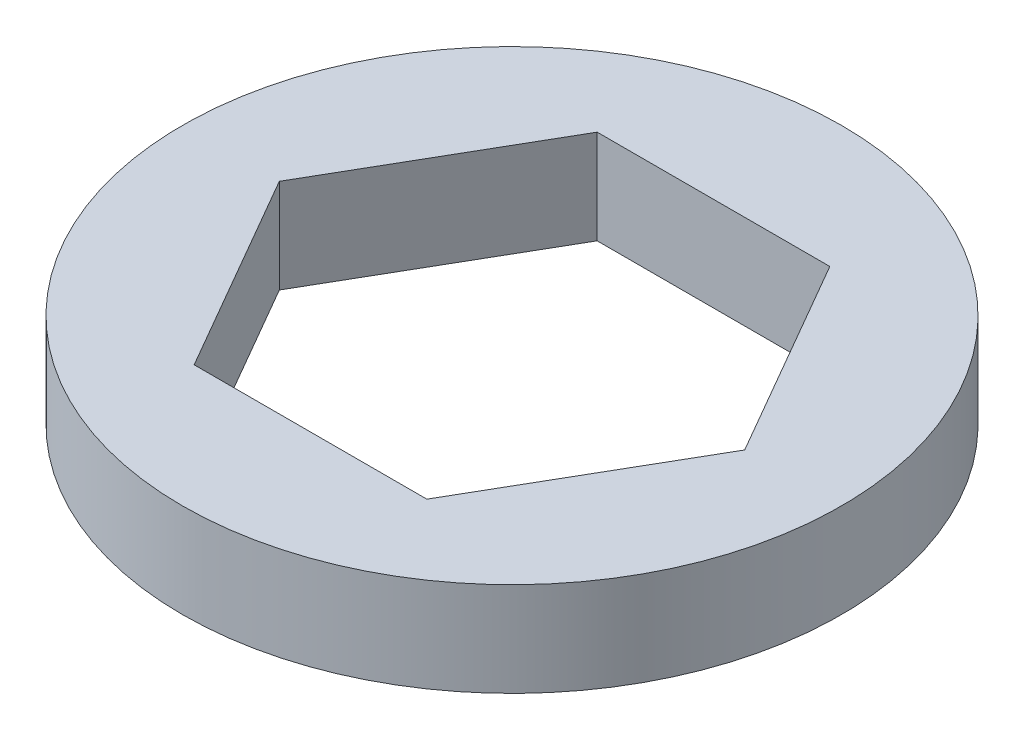
ISO-10303-21;
HEADER;
FILE_DESCRIPTION(('STEP AP214'),'2;1');
FILE_NAME('part.step','',(''),(''),'','','');
FILE_SCHEMA(('AUTOMOTIVE_DESIGN { 1 0 10303 214 1 1 1 1 }'));
ENDSEC;
DATA;
#1=APPLICATION_CONTEXT('core data for automotive mechanical design processes');
#2=APPLICATION_PROTOCOL_DEFINITION('international standard','automotive_design',2000,#1);
#3=PRODUCT_CONTEXT('',#1,'mechanical');
#4=PRODUCT('Part','Part','',(#3));
#5=PRODUCT_RELATED_PRODUCT_CATEGORY('part','',(#4));
#6=PRODUCT_DEFINITION_FORMATION('','',#4);
#7=PRODUCT_DEFINITION_CONTEXT('part definition',#1,'design');
#8=PRODUCT_DEFINITION('design','',#6,#7);
#9=PRODUCT_DEFINITION_SHAPE('','',#8);
#10=(LENGTH_UNIT() NAMED_UNIT(*) SI_UNIT(.MILLI.,.METRE.));
#11=(NAMED_UNIT(*) PLANE_ANGLE_UNIT() SI_UNIT($,.RADIAN.));
#12=(NAMED_UNIT(*) SI_UNIT($,.STERADIAN.) SOLID_ANGLE_UNIT());
#13=UNCERTAINTY_MEASURE_WITH_UNIT(LENGTH_MEASURE(1.E-05),#10,'distance_accuracy_value','');
#14=(GEOMETRIC_REPRESENTATION_CONTEXT(3) GLOBAL_UNCERTAINTY_ASSIGNED_CONTEXT((#13)) GLOBAL_UNIT_ASSIGNED_CONTEXT((#10,
#11,#12)) REPRESENTATION_CONTEXT('',''));
#15=CARTESIAN_POINT('',(0.,0.,0.));
#16=DIRECTION('',(0.,0.,1.));
#17=DIRECTION('',(1.,0.,0.));
#18=AXIS2_PLACEMENT_3D('',#15,#16,#17);
#19=CARTESIAN_POINT('',(0.,3.175,0.));
#20=DIRECTION('',(0.,1.,0.));
#21=DIRECTION('',(0.,0.,1.));
#22=AXIS2_PLACEMENT_3D('',#19,#20,#21);
#23=PLANE('',#22);
#24=CARTESIAN_POINT('',(0.,3.175,0.));
#25=DIRECTION('',(0.,1.,0.));
#26=DIRECTION('',(0.,0.,1.));
#27=AXIS2_PLACEMENT_3D('',#24,#25,#26);
#28=CIRCLE('',#27,11.1125);
#29=CARTESIAN_POINT('',(0.,3.175,11.1125));
#30=VERTEX_POINT('',#29);
#31=EDGE_CURVE('E11',#30,#30,#28,.T.);
#32=ORIENTED_EDGE('',*,*,#31,.T.);
#33=EDGE_LOOP('',(#32));
#34=FACE_BOUND('',#33,.T.);
#35=DIRECTION('',(-0.5,0.,-0.866025403784439));
#36=VECTOR('',#35,1.);
#37=CARTESIAN_POINT('',(7.84561280801783,3.175,0.));
#38=LINE('',#37,#36);
#39=CARTESIAN_POINT('',(7.84561280801783,3.175,0.));
#40=VERTEX_POINT('',#39);
#41=CARTESIAN_POINT('',(3.9228064040089,3.175,-6.79450000000002));
#42=VERTEX_POINT('',#41);
#43=EDGE_CURVE('E107',#40,#42,#38,.T.);
#44=ORIENTED_EDGE('',*,*,#43,.F.);
#45=DIRECTION('',(0.5,0.,-0.866025403784439));
#46=VECTOR('',#45,1.);
#47=CARTESIAN_POINT('',(3.92280640400891,3.175,6.79450000000001));
#48=LINE('',#47,#46);
#49=CARTESIAN_POINT('',(3.92280640400891,3.175,6.79450000000001));
#50=VERTEX_POINT('',#49);
#51=EDGE_CURVE('E98',#50,#40,#48,.T.);
#52=ORIENTED_EDGE('',*,*,#51,.F.);
#53=DIRECTION('',(1.,0.,0.));
#54=VECTOR('',#53,1.);
#55=CARTESIAN_POINT('',(-3.92280640400892,3.175,6.79450000000001));
#56=LINE('',#55,#54);
#57=CARTESIAN_POINT('',(-3.92280640400892,3.175,6.79450000000001));
#58=VERTEX_POINT('',#57);
#59=EDGE_CURVE('E131',#58,#50,#56,.T.);
#60=ORIENTED_EDGE('',*,*,#59,.F.);
#61=DIRECTION('',(0.5,0.,0.866025403784439));
#62=VECTOR('',#61,1.);
#63=CARTESIAN_POINT('',(-7.84561280801784,3.175,0.));
#64=LINE('',#63,#62);
#65=CARTESIAN_POINT('',(-7.84561280801784,3.175,0.));
#66=VERTEX_POINT('',#65);
#67=EDGE_CURVE('E128',#66,#58,#64,.T.);
#68=ORIENTED_EDGE('',*,*,#67,.F.);
#69=DIRECTION('',(-0.5,0.,0.866025403784439));
#70=VECTOR('',#69,1.);
#71=CARTESIAN_POINT('',(-3.92280640400892,3.175,-6.79450000000002));
#72=LINE('',#71,#70);
#73=CARTESIAN_POINT('',(-3.92280640400892,3.175,-6.79450000000002));
#74=VERTEX_POINT('',#73);
#75=EDGE_CURVE('E124',#74,#66,#72,.T.);
#76=ORIENTED_EDGE('',*,*,#75,.F.);
#77=DIRECTION('',(-1.,0.,0.));
#78=VECTOR('',#77,1.);
#79=CARTESIAN_POINT('',(3.9228064040089,3.175,-6.79450000000002));
#80=LINE('',#79,#78);
#81=EDGE_CURVE('E120',#42,#74,#80,.T.);
#82=ORIENTED_EDGE('',*,*,#81,.F.);
#83=EDGE_LOOP('',(#44,#52,#60,#68,#76,#82));
#84=FACE_BOUND('',#83,.T.);
#85=ADVANCED_FACE('F36',(#34,#84),#23,.T.);
#86=CARTESIAN_POINT('',(0.,0.,0.));
#87=DIRECTION('',(0.,1.,0.));
#88=DIRECTION('',(0.,0.,1.));
#89=AXIS2_PLACEMENT_3D('',#86,#87,#88);
#90=PLANE('',#89);
#91=CARTESIAN_POINT('',(0.,0.,0.));
#92=DIRECTION('',(0.,1.,0.));
#93=DIRECTION('',(0.,0.,1.));
#94=AXIS2_PLACEMENT_3D('',#91,#92,#93);
#95=CIRCLE('',#94,11.1125);
#96=CARTESIAN_POINT('',(0.,0.,11.1125));
#97=VERTEX_POINT('',#96);
#98=EDGE_CURVE('E40',#97,#97,#95,.T.);
#99=ORIENTED_EDGE('',*,*,#98,.F.);
#100=EDGE_LOOP('',(#99));
#101=FACE_BOUND('',#100,.T.);
#102=DIRECTION('',(0.5,0.,-0.866025403784439));
#103=VECTOR('',#102,1.);
#104=CARTESIAN_POINT('',(3.92280640400891,0.,6.79450000000001));
#105=LINE('',#104,#103);
#106=CARTESIAN_POINT('',(3.92280640400891,0.,6.79450000000001));
#107=VERTEX_POINT('',#106);
#108=CARTESIAN_POINT('',(7.84561280801783,0.,0.));
#109=VERTEX_POINT('',#108);
#110=EDGE_CURVE('E64',#107,#109,#105,.T.);
#111=ORIENTED_EDGE('',*,*,#110,.T.);
#112=DIRECTION('',(-0.5,0.,-0.866025403784439));
#113=VECTOR('',#112,1.);
#114=CARTESIAN_POINT('',(7.84561280801783,0.,0.));
#115=LINE('',#114,#113);
#116=CARTESIAN_POINT('',(3.9228064040089,0.,-6.79450000000002));
#117=VERTEX_POINT('',#116);
#118=EDGE_CURVE('E114',#109,#117,#115,.T.);
#119=ORIENTED_EDGE('',*,*,#118,.T.);
#120=DIRECTION('',(-1.,0.,0.));
#121=VECTOR('',#120,1.);
#122=CARTESIAN_POINT('',(3.9228064040089,0.,-6.79450000000002));
#123=LINE('',#122,#121);
#124=CARTESIAN_POINT('',(-3.92280640400892,0.,-6.79450000000002));
#125=VERTEX_POINT('',#124);
#126=EDGE_CURVE('E138',#117,#125,#123,.T.);
#127=ORIENTED_EDGE('',*,*,#126,.T.);
#128=DIRECTION('',(-0.5,0.,0.866025403784439));
#129=VECTOR('',#128,1.);
#130=CARTESIAN_POINT('',(-3.92280640400892,0.,-6.79450000000002));
#131=LINE('',#130,#129);
#132=CARTESIAN_POINT('',(-7.84561280801784,0.,0.));
#133=VERTEX_POINT('',#132);
#134=EDGE_CURVE('E141',#125,#133,#131,.T.);
#135=ORIENTED_EDGE('',*,*,#134,.T.);
#136=DIRECTION('',(0.5,0.,0.866025403784439));
#137=VECTOR('',#136,1.);
#138=CARTESIAN_POINT('',(-7.84561280801784,0.,0.));
#139=LINE('',#138,#137);
#140=CARTESIAN_POINT('',(-3.92280640400892,0.,6.79450000000001));
#141=VERTEX_POINT('',#140);
#142=EDGE_CURVE('E144',#133,#141,#139,.T.);
#143=ORIENTED_EDGE('',*,*,#142,.T.);
#144=DIRECTION('',(1.,0.,0.));
#145=VECTOR('',#144,1.);
#146=CARTESIAN_POINT('',(-3.92280640400892,0.,6.79450000000001));
#147=LINE('',#146,#145);
#148=EDGE_CURVE('E108',#141,#107,#147,.T.);
#149=ORIENTED_EDGE('',*,*,#148,.T.);
#150=EDGE_LOOP('',(#111,#119,#127,#135,#143,#149));
#151=FACE_BOUND('',#150,.T.);
#152=ADVANCED_FACE('F166',(#101,#151),#90,.F.);
#153=CARTESIAN_POINT('',(0.,3.175,0.));
#154=DIRECTION('',(0.,-1.,0.));
#155=DIRECTION('',(0.,0.,-1.));
#156=AXIS2_PLACEMENT_3D('',#153,#154,#155);
#157=CYLINDRICAL_SURFACE('',#156,11.1125);
#158=ORIENTED_EDGE('',*,*,#31,.F.);
#159=EDGE_LOOP('',(#158));
#160=FACE_BOUND('',#159,.T.);
#161=ORIENTED_EDGE('',*,*,#98,.T.);
#162=EDGE_LOOP('',(#161));
#163=FACE_BOUND('',#162,.T.);
#164=ADVANCED_FACE('F38',(#160,#163),#157,.T.);
#165=CARTESIAN_POINT('',(3.92280640400891,3.175,6.79450000000001));
#166=DIRECTION('',(-0.866025403784439,0.,-0.5));
#167=DIRECTION('',(-0.5,0.,0.866025403784439));
#168=AXIS2_PLACEMENT_3D('',#165,#166,#167);
#169=PLANE('',#168);
#170=ORIENTED_EDGE('',*,*,#110,.F.);
#171=DIRECTION('',(0.,-1.,0.));
#172=VECTOR('',#171,1.);
#173=CARTESIAN_POINT('',(3.92280640400891,3.175,6.79450000000001));
#174=LINE('',#173,#172);
#175=EDGE_CURVE('E102',#50,#107,#174,.T.);
#176=ORIENTED_EDGE('',*,*,#175,.F.);
#177=ORIENTED_EDGE('',*,*,#51,.T.);
#178=DIRECTION('',(0.,-1.,0.));
#179=VECTOR('',#178,1.);
#180=CARTESIAN_POINT('',(7.84561280801783,3.175,0.));
#181=LINE('',#180,#179);
#182=EDGE_CURVE('E101',#40,#109,#181,.T.);
#183=ORIENTED_EDGE('',*,*,#182,.T.);
#184=EDGE_LOOP('',(#170,#176,#177,#183));
#185=FACE_BOUND('',#184,.T.);
#186=ADVANCED_FACE('F100',(#185),#169,.T.);
#187=CARTESIAN_POINT('',(7.84561280801783,3.175,0.));
#188=DIRECTION('',(-0.866025403784439,0.,0.5));
#189=DIRECTION('',(0.5,0.,0.866025403784439));
#190=AXIS2_PLACEMENT_3D('',#187,#188,#189);
#191=PLANE('',#190);
#192=ORIENTED_EDGE('',*,*,#118,.F.);
#193=ORIENTED_EDGE('',*,*,#182,.F.);
#194=ORIENTED_EDGE('',*,*,#43,.T.);
#195=DIRECTION('',(0.,-1.,0.));
#196=VECTOR('',#195,1.);
#197=CARTESIAN_POINT('',(3.9228064040089,3.175,-6.79450000000002));
#198=LINE('',#197,#196);
#199=EDGE_CURVE('E116',#42,#117,#198,.T.);
#200=ORIENTED_EDGE('',*,*,#199,.T.);
#201=EDGE_LOOP('',(#192,#193,#194,#200));
#202=FACE_BOUND('',#201,.T.);
#203=ADVANCED_FACE('F111',(#202),#191,.T.);
#204=CARTESIAN_POINT('',(3.9228064040089,3.175,-6.79450000000002));
#205=DIRECTION('',(0.,0.,1.));
#206=DIRECTION('',(1.,0.,0.));
#207=AXIS2_PLACEMENT_3D('',#204,#205,#206);
#208=PLANE('',#207);
#209=ORIENTED_EDGE('',*,*,#126,.F.);
#210=ORIENTED_EDGE('',*,*,#199,.F.);
#211=ORIENTED_EDGE('',*,*,#81,.T.);
#212=DIRECTION('',(0.,-1.,0.));
#213=VECTOR('',#212,1.);
#214=CARTESIAN_POINT('',(-3.92280640400892,3.175,-6.79450000000002));
#215=LINE('',#214,#213);
#216=EDGE_CURVE('E158',#74,#125,#215,.T.);
#217=ORIENTED_EDGE('',*,*,#216,.T.);
#218=EDGE_LOOP('',(#209,#210,#211,#217));
#219=FACE_BOUND('',#218,.T.);
#220=ADVANCED_FACE('F162',(#219),#208,.T.);
#221=CARTESIAN_POINT('',(-3.92280640400892,3.175,-6.79450000000002));
#222=DIRECTION('',(0.866025403784439,0.,0.5));
#223=DIRECTION('',(0.5,0.,-0.866025403784439));
#224=AXIS2_PLACEMENT_3D('',#221,#222,#223);
#225=PLANE('',#224);
#226=ORIENTED_EDGE('',*,*,#134,.F.);
#227=ORIENTED_EDGE('',*,*,#216,.F.);
#228=ORIENTED_EDGE('',*,*,#75,.T.);
#229=DIRECTION('',(0.,-1.,0.));
#230=VECTOR('',#229,1.);
#231=CARTESIAN_POINT('',(-7.84561280801784,3.175,0.));
#232=LINE('',#231,#230);
#233=EDGE_CURVE('E155',#66,#133,#232,.T.);
#234=ORIENTED_EDGE('',*,*,#233,.T.);
#235=EDGE_LOOP('',(#226,#227,#228,#234));
#236=FACE_BOUND('',#235,.T.);
#237=ADVANCED_FACE('F174',(#236),#225,.T.);
#238=CARTESIAN_POINT('',(-7.84561280801784,3.175,0.));
#239=DIRECTION('',(0.866025403784439,0.,-0.5));
#240=DIRECTION('',(-0.5,0.,-0.866025403784439));
#241=AXIS2_PLACEMENT_3D('',#238,#239,#240);
#242=PLANE('',#241);
#243=ORIENTED_EDGE('',*,*,#142,.F.);
#244=ORIENTED_EDGE('',*,*,#233,.F.);
#245=ORIENTED_EDGE('',*,*,#67,.T.);
#246=DIRECTION('',(0.,-1.,0.));
#247=VECTOR('',#246,1.);
#248=CARTESIAN_POINT('',(-3.92280640400892,3.175,6.79450000000001));
#249=LINE('',#248,#247);
#250=EDGE_CURVE('E55',#58,#141,#249,.T.);
#251=ORIENTED_EDGE('',*,*,#250,.T.);
#252=EDGE_LOOP('',(#243,#244,#245,#251));
#253=FACE_BOUND('',#252,.T.);
#254=ADVANCED_FACE('F172',(#253),#242,.T.);
#255=CARTESIAN_POINT('',(-3.92280640400892,3.175,6.79450000000001));
#256=DIRECTION('',(0.,0.,-1.));
#257=DIRECTION('',(-1.,0.,0.));
#258=AXIS2_PLACEMENT_3D('',#255,#256,#257);
#259=PLANE('',#258);
#260=ORIENTED_EDGE('',*,*,#148,.F.);
#261=ORIENTED_EDGE('',*,*,#250,.F.);
#262=ORIENTED_EDGE('',*,*,#59,.T.);
#263=ORIENTED_EDGE('',*,*,#175,.T.);
#264=EDGE_LOOP('',(#260,#261,#262,#263));
#265=FACE_BOUND('',#264,.T.);
#266=ADVANCED_FACE('F168',(#265),#259,.T.);
#267=CLOSED_SHELL('',(#85,#152,#164,#186,#203,#220,#237,#254,#266));
#268=MANIFOLD_SOLID_BREP('B2',#267);
#269=ADVANCED_BREP_SHAPE_REPRESENTATION('',(#18,#268),#14);
#270=SHAPE_DEFINITION_REPRESENTATION(#9,#269);
ENDSEC;
END-ISO-10303-21;
